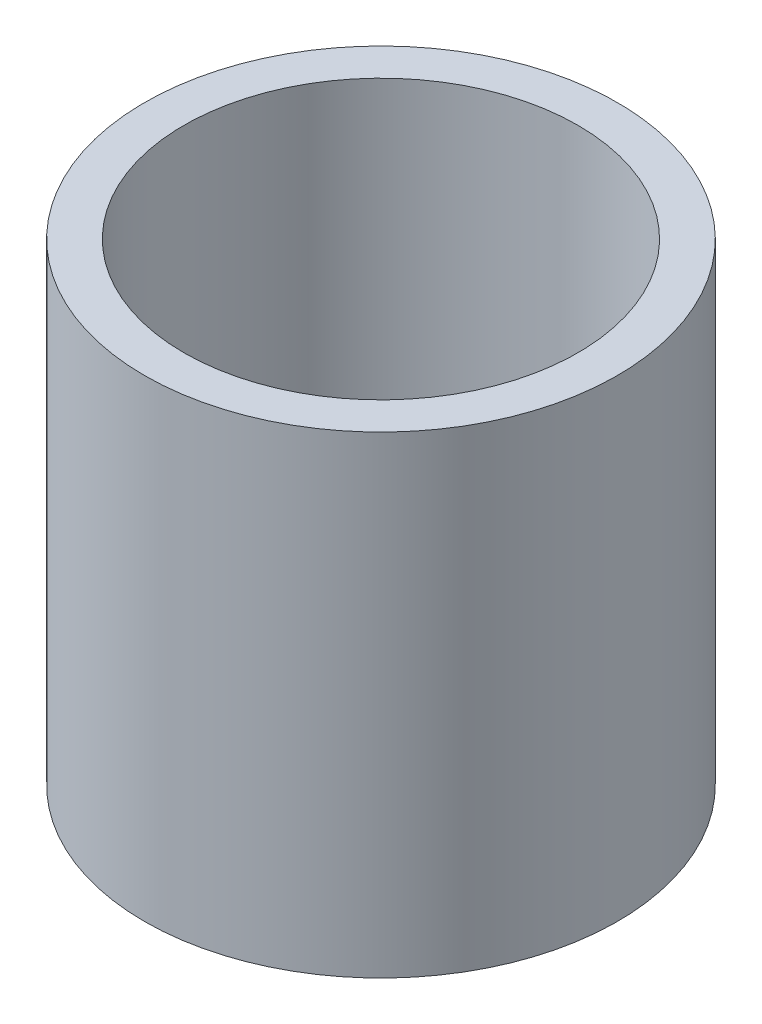
ISO-10303-21;
HEADER;
FILE_DESCRIPTION(('STEP AP214'),'2;1');
FILE_NAME('part.step','',(''),(''),'','','');
FILE_SCHEMA(('AUTOMOTIVE_DESIGN { 1 0 10303 214 1 1 1 1 }'));
ENDSEC;
DATA;
#1=APPLICATION_CONTEXT('core data for automotive mechanical design processes');
#2=APPLICATION_PROTOCOL_DEFINITION('international standard','automotive_design',2000,#1);
#3=PRODUCT_CONTEXT('',#1,'mechanical');
#4=PRODUCT('Part','Part','',(#3));
#5=PRODUCT_RELATED_PRODUCT_CATEGORY('part','',(#4));
#6=PRODUCT_DEFINITION_FORMATION('','',#4);
#7=PRODUCT_DEFINITION_CONTEXT('part definition',#1,'design');
#8=PRODUCT_DEFINITION('design','',#6,#7);
#9=PRODUCT_DEFINITION_SHAPE('','',#8);
#10=(LENGTH_UNIT() NAMED_UNIT(*) SI_UNIT(.MILLI.,.METRE.));
#11=(NAMED_UNIT(*) PLANE_ANGLE_UNIT() SI_UNIT($,.RADIAN.));
#12=(NAMED_UNIT(*) SI_UNIT($,.STERADIAN.) SOLID_ANGLE_UNIT());
#13=UNCERTAINTY_MEASURE_WITH_UNIT(LENGTH_MEASURE(1.E-05),#10,'distance_accuracy_value','');
#14=(GEOMETRIC_REPRESENTATION_CONTEXT(3) GLOBAL_UNCERTAINTY_ASSIGNED_CONTEXT((#13)) GLOBAL_UNIT_ASSIGNED_CONTEXT((#10,
#11,#12)) REPRESENTATION_CONTEXT('',''));
#15=CARTESIAN_POINT('',(0.,0.,0.));
#16=DIRECTION('',(0.,0.,1.));
#17=DIRECTION('',(1.,0.,0.));
#18=AXIS2_PLACEMENT_3D('',#15,#16,#17);
#19=CARTESIAN_POINT('',(0.,18.,0.));
#20=DIRECTION('',(0.,1.,0.));
#21=DIRECTION('',(0.,0.,1.));
#22=AXIS2_PLACEMENT_3D('',#19,#20,#21);
#23=PLANE('',#22);
#24=CARTESIAN_POINT('',(0.,18.,0.));
#25=DIRECTION('',(0.,1.,0.));
#26=DIRECTION('',(0.,0.,1.));
#27=AXIS2_PLACEMENT_3D('',#24,#25,#26);
#28=CIRCLE('',#27,9.);
#29=CARTESIAN_POINT('',(0.,18.,9.));
#30=VERTEX_POINT('',#29);
#31=EDGE_CURVE('E10',#30,#30,#28,.T.);
#32=ORIENTED_EDGE('',*,*,#31,.T.);
#33=EDGE_LOOP('',(#32));
#34=FACE_BOUND('',#33,.T.);
#35=CARTESIAN_POINT('',(0.,18.,0.));
#36=DIRECTION('',(0.,1.,0.));
#37=DIRECTION('',(0.,0.,1.));
#38=AXIS2_PLACEMENT_3D('',#35,#36,#37);
#39=CIRCLE('',#38,7.5);
#40=CARTESIAN_POINT('',(0.,18.,7.5));
#41=VERTEX_POINT('',#40);
#42=EDGE_CURVE('E42',#41,#41,#39,.T.);
#43=ORIENTED_EDGE('',*,*,#42,.F.);
#44=EDGE_LOOP('',(#43));
#45=FACE_BOUND('',#44,.T.);
#46=ADVANCED_FACE('F31',(#34,#45),#23,.T.);
#47=CARTESIAN_POINT('',(0.,0.,0.));
#48=DIRECTION('',(0.,1.,0.));
#49=DIRECTION('',(0.,0.,1.));
#50=AXIS2_PLACEMENT_3D('',#47,#48,#49);
#51=PLANE('',#50);
#52=CARTESIAN_POINT('',(0.,0.,0.));
#53=DIRECTION('',(0.,1.,0.));
#54=DIRECTION('',(0.,0.,1.));
#55=AXIS2_PLACEMENT_3D('',#52,#53,#54);
#56=CIRCLE('',#55,9.);
#57=CARTESIAN_POINT('',(0.,0.,9.));
#58=VERTEX_POINT('',#57);
#59=EDGE_CURVE('E35',#58,#58,#56,.T.);
#60=ORIENTED_EDGE('',*,*,#59,.F.);
#61=EDGE_LOOP('',(#60));
#62=FACE_BOUND('',#61,.T.);
#63=CARTESIAN_POINT('',(0.,0.,0.));
#64=DIRECTION('',(0.,1.,0.));
#65=DIRECTION('',(0.,0.,1.));
#66=AXIS2_PLACEMENT_3D('',#63,#64,#65);
#67=CIRCLE('',#66,7.5);
#68=CARTESIAN_POINT('',(0.,0.,7.5));
#69=VERTEX_POINT('',#68);
#70=EDGE_CURVE('E44',#69,#69,#67,.T.);
#71=ORIENTED_EDGE('',*,*,#70,.T.);
#72=EDGE_LOOP('',(#71));
#73=FACE_BOUND('',#72,.T.);
#74=ADVANCED_FACE('F54',(#62,#73),#51,.F.);
#75=CARTESIAN_POINT('',(0.,18.,0.));
#76=DIRECTION('',(0.,-1.,0.));
#77=DIRECTION('',(0.,0.,-1.));
#78=AXIS2_PLACEMENT_3D('',#75,#76,#77);
#79=CYLINDRICAL_SURFACE('',#78,9.);
#80=ORIENTED_EDGE('',*,*,#31,.F.);
#81=EDGE_LOOP('',(#80));
#82=FACE_BOUND('',#81,.T.);
#83=ORIENTED_EDGE('',*,*,#59,.T.);
#84=EDGE_LOOP('',(#83));
#85=FACE_BOUND('',#84,.T.);
#86=ADVANCED_FACE('F33',(#82,#85),#79,.T.);
#87=CARTESIAN_POINT('',(0.,18.,0.));
#88=DIRECTION('',(0.,-1.,0.));
#89=DIRECTION('',(0.,0.,-1.));
#90=AXIS2_PLACEMENT_3D('',#87,#88,#89);
#91=CYLINDRICAL_SURFACE('',#90,7.5);
#92=ORIENTED_EDGE('',*,*,#42,.T.);
#93=EDGE_LOOP('',(#92));
#94=FACE_BOUND('',#93,.T.);
#95=ORIENTED_EDGE('',*,*,#70,.F.);
#96=EDGE_LOOP('',(#95));
#97=FACE_BOUND('',#96,.T.);
#98=ADVANCED_FACE('F50',(#94,#97),#91,.F.);
#99=CLOSED_SHELL('',(#46,#74,#86,#98));
#100=MANIFOLD_SOLID_BREP('B2',#99);
#101=ADVANCED_BREP_SHAPE_REPRESENTATION('',(#18,#100),#14);
#102=SHAPE_DEFINITION_REPRESENTATION(#9,#101);
ENDSEC;
END-ISO-10303-21;
